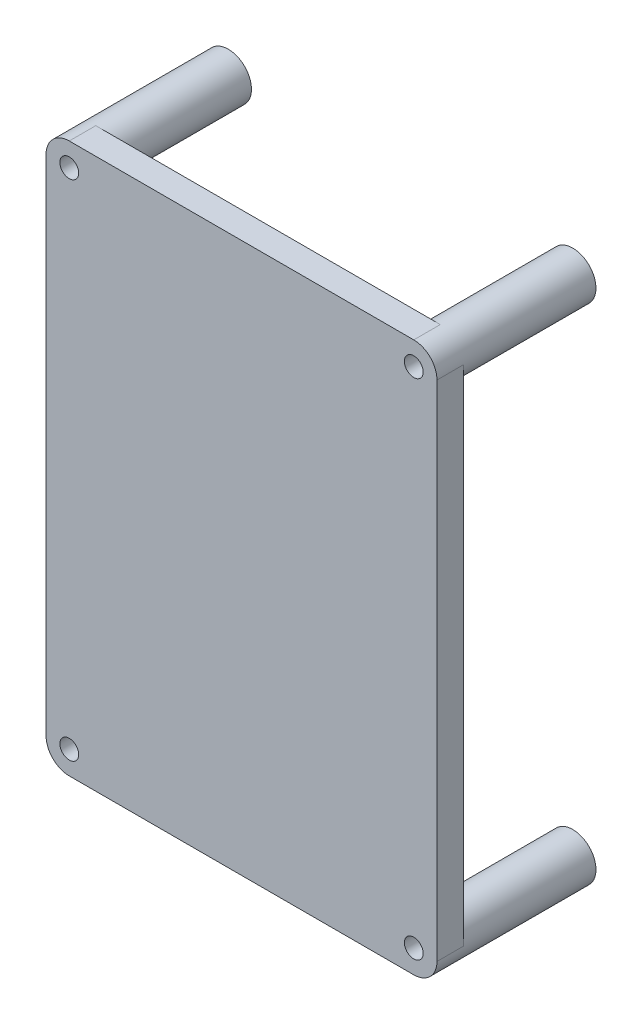
ISO-10303-21;
HEADER;
FILE_DESCRIPTION(('STEP AP214'),'2;1');
FILE_NAME('part.step','',(''),(''),'','','');
FILE_SCHEMA(('AUTOMOTIVE_DESIGN { 1 0 10303 214 1 1 1 1 }'));
ENDSEC;
DATA;
#1=APPLICATION_CONTEXT('core data for automotive mechanical design processes');
#2=APPLICATION_PROTOCOL_DEFINITION('international standard','automotive_design',2000,#1);
#3=PRODUCT_CONTEXT('',#1,'mechanical');
#4=PRODUCT('Part','Part','',(#3));
#5=PRODUCT_RELATED_PRODUCT_CATEGORY('part','',(#4));
#6=PRODUCT_DEFINITION_FORMATION('','',#4);
#7=PRODUCT_DEFINITION_CONTEXT('part definition',#1,'design');
#8=PRODUCT_DEFINITION('design','',#6,#7);
#9=PRODUCT_DEFINITION_SHAPE('','',#8);
#10=(LENGTH_UNIT() NAMED_UNIT(*) SI_UNIT(.MILLI.,.METRE.));
#11=(NAMED_UNIT(*) PLANE_ANGLE_UNIT() SI_UNIT($,.RADIAN.));
#12=(NAMED_UNIT(*) SI_UNIT($,.STERADIAN.) SOLID_ANGLE_UNIT());
#13=UNCERTAINTY_MEASURE_WITH_UNIT(LENGTH_MEASURE(1.E-05),#10,'distance_accuracy_value','');
#14=(GEOMETRIC_REPRESENTATION_CONTEXT(3) GLOBAL_UNCERTAINTY_ASSIGNED_CONTEXT((#13)) GLOBAL_UNIT_ASSIGNED_CONTEXT((#10,
#11,#12)) REPRESENTATION_CONTEXT('',''));
#15=CARTESIAN_POINT('',(0.,0.,0.));
#16=DIRECTION('',(0.,0.,1.));
#17=DIRECTION('',(1.,0.,0.));
#18=AXIS2_PLACEMENT_3D('',#15,#16,#17);
#19=CARTESIAN_POINT('',(160.526557276723,113.230165260636,186.266714262562));
#20=DIRECTION('',(0.,0.,-1.));
#21=DIRECTION('',(-1.,0.,0.));
#22=AXIS2_PLACEMENT_3D('',#19,#20,#21);
#23=PLANE('',#22);
#24=CARTESIAN_POINT('',(160.526557276723,113.230165260636,186.266714262562));
#25=DIRECTION('',(0.,0.,-1.));
#26=DIRECTION('',(-1.,0.,0.));
#27=AXIS2_PLACEMENT_3D('',#24,#25,#26);
#28=CIRCLE('',#27,1.42240000000002);
#29=CARTESIAN_POINT('',(159.104157276723,113.230165260636,186.266714262562));
#30=VERTEX_POINT('',#29);
#31=EDGE_CURVE('E95',#30,#30,#28,.F.);
#32=ORIENTED_EDGE('',*,*,#31,.T.);
#33=EDGE_LOOP('',(#32));
#34=FACE_BOUND('',#33,.T.);
#35=CARTESIAN_POINT('',(160.526557276723,113.230165260636,186.266714262562));
#36=DIRECTION('',(0.,0.,-1.));
#37=DIRECTION('',(-1.,0.,0.));
#38=AXIS2_PLACEMENT_3D('',#35,#36,#37);
#39=CIRCLE('',#38,3.5);
#40=CARTESIAN_POINT('',(157.026557276723,113.230165260636,186.266714262562));
#41=VERTEX_POINT('',#40);
#42=EDGE_CURVE('E94',#41,#41,#39,.F.);
#43=ORIENTED_EDGE('',*,*,#42,.F.);
#44=EDGE_LOOP('',(#43));
#45=FACE_BOUND('',#44,.T.);
#46=ADVANCED_FACE('F17',(#34,#45),#23,.T.);
#47=CARTESIAN_POINT('',(160.526557276723,189.230165260636,186.266714262562));
#48=DIRECTION('',(0.,0.,-1.));
#49=DIRECTION('',(-1.,0.,0.));
#50=AXIS2_PLACEMENT_3D('',#47,#48,#49);
#51=PLANE('',#50);
#52=CARTESIAN_POINT('',(160.526557276723,189.230165260636,186.266714262562));
#53=DIRECTION('',(0.,0.,-1.));
#54=DIRECTION('',(-1.,0.,0.));
#55=AXIS2_PLACEMENT_3D('',#52,#53,#54);
#56=CIRCLE('',#55,1.42240000000002);
#57=CARTESIAN_POINT('',(159.104157276723,189.230165260636,186.266714262562));
#58=VERTEX_POINT('',#57);
#59=EDGE_CURVE('E20',#58,#58,#56,.F.);
#60=ORIENTED_EDGE('',*,*,#59,.T.);
#61=EDGE_LOOP('',(#60));
#62=FACE_BOUND('',#61,.T.);
#63=CARTESIAN_POINT('',(160.526557276723,189.230165260636,186.266714262562));
#64=DIRECTION('',(0.,0.,-1.));
#65=DIRECTION('',(-1.,0.,0.));
#66=AXIS2_PLACEMENT_3D('',#63,#64,#65);
#67=CIRCLE('',#66,3.5);
#68=CARTESIAN_POINT('',(157.026557276723,189.230165260636,186.266714262562));
#69=VERTEX_POINT('',#68);
#70=EDGE_CURVE('E163',#69,#69,#67,.F.);
#71=ORIENTED_EDGE('',*,*,#70,.F.);
#72=EDGE_LOOP('',(#71));
#73=FACE_BOUND('',#72,.T.);
#74=ADVANCED_FACE('F171',(#62,#73),#51,.T.);
#75=CARTESIAN_POINT('',(160.526557276723,113.230165260636,206.266714262562));
#76=DIRECTION('',(0.,0.,1.));
#77=DIRECTION('',(1.,0.,0.));
#78=AXIS2_PLACEMENT_3D('',#75,#76,#77);
#79=PLANE('',#78);
#80=DIRECTION('',(0.,1.,0.));
#81=VECTOR('',#80,1.);
#82=CARTESIAN_POINT('',(105.026557276723,189.230165260636,206.266714262562));
#83=LINE('',#82,#81);
#84=CARTESIAN_POINT('',(105.026557276723,113.230165260636,206.266714262562));
#85=VERTEX_POINT('',#84);
#86=CARTESIAN_POINT('',(105.026557276723,189.230165260636,206.266714262562));
#87=VERTEX_POINT('',#86);
#88=EDGE_CURVE('E117',#85,#87,#83,.T.);
#89=ORIENTED_EDGE('',*,*,#88,.T.);
#90=CARTESIAN_POINT('',(108.526557276723,189.230165260636,206.266714262562));
#91=DIRECTION('',(0.,0.,-1.));
#92=DIRECTION('',(-1.,0.,0.));
#93=AXIS2_PLACEMENT_3D('',#90,#91,#92);
#94=CIRCLE('',#93,3.49999999999999);
#95=CARTESIAN_POINT('',(108.526557276723,192.730165260636,206.266714262562));
#96=VERTEX_POINT('',#95);
#97=EDGE_CURVE('E122',#96,#87,#94,.T.);
#98=ORIENTED_EDGE('',*,*,#97,.F.);
#99=DIRECTION('',(1.,0.,0.));
#100=VECTOR('',#99,1.);
#101=CARTESIAN_POINT('',(160.526557276723,192.730165260636,206.266714262562));
#102=LINE('',#101,#100);
#103=CARTESIAN_POINT('',(160.526557276723,192.730165260636,206.266714262562));
#104=VERTEX_POINT('',#103);
#105=EDGE_CURVE('E121',#96,#104,#102,.T.);
#106=ORIENTED_EDGE('',*,*,#105,.T.);
#107=CARTESIAN_POINT('',(160.526557276723,189.230165260636,206.266714262562));
#108=DIRECTION('',(0.,0.,-1.));
#109=DIRECTION('',(-1.,0.,0.));
#110=AXIS2_PLACEMENT_3D('',#107,#108,#109);
#111=CIRCLE('',#110,3.5);
#112=CARTESIAN_POINT('',(164.026557276723,189.230165260636,206.266714262562));
#113=VERTEX_POINT('',#112);
#114=EDGE_CURVE('E79',#113,#104,#111,.T.);
#115=ORIENTED_EDGE('',*,*,#114,.F.);
#116=DIRECTION('',(0.,-1.,0.));
#117=VECTOR('',#116,1.);
#118=CARTESIAN_POINT('',(164.026557276723,113.230165260636,206.266714262562));
#119=LINE('',#118,#117);
#120=CARTESIAN_POINT('',(164.026557276723,113.230165260636,206.266714262562));
#121=VERTEX_POINT('',#120);
#122=EDGE_CURVE('E97',#113,#121,#119,.T.);
#123=ORIENTED_EDGE('',*,*,#122,.T.);
#124=CARTESIAN_POINT('',(160.526557276723,113.230165260636,206.266714262562));
#125=DIRECTION('',(0.,0.,-1.));
#126=DIRECTION('',(-1.,0.,0.));
#127=AXIS2_PLACEMENT_3D('',#124,#125,#126);
#128=CIRCLE('',#127,3.5);
#129=CARTESIAN_POINT('',(160.526557276723,109.730165260636,206.266714262562));
#130=VERTEX_POINT('',#129);
#131=EDGE_CURVE('E84',#130,#121,#128,.T.);
#132=ORIENTED_EDGE('',*,*,#131,.F.);
#133=DIRECTION('',(-1.,0.,0.));
#134=VECTOR('',#133,1.);
#135=CARTESIAN_POINT('',(108.526557276723,109.730165260636,206.266714262562));
#136=LINE('',#135,#134);
#137=CARTESIAN_POINT('',(108.526557276723,109.730165260636,206.266714262562));
#138=VERTEX_POINT('',#137);
#139=EDGE_CURVE('E114',#130,#138,#136,.T.);
#140=ORIENTED_EDGE('',*,*,#139,.T.);
#141=CARTESIAN_POINT('',(108.526557276723,113.230165260636,206.266714262562));
#142=DIRECTION('',(0.,0.,-1.));
#143=DIRECTION('',(-1.,0.,0.));
#144=AXIS2_PLACEMENT_3D('',#141,#142,#143);
#145=CIRCLE('',#144,3.50000000000002);
#146=EDGE_CURVE('E119',#85,#138,#145,.T.);
#147=ORIENTED_EDGE('',*,*,#146,.F.);
#148=EDGE_LOOP('',(#89,#98,#106,#115,#123,#132,#140,#147));
#149=FACE_BOUND('',#148,.T.);
#150=ADVANCED_FACE('F99',(#149),#79,.F.);
#151=CARTESIAN_POINT('',(108.526557276723,113.230165260636,186.266714262562));
#152=DIRECTION('',(0.,0.,-1.));
#153=DIRECTION('',(-1.,0.,0.));
#154=AXIS2_PLACEMENT_3D('',#151,#152,#153);
#155=PLANE('',#154);
#156=CARTESIAN_POINT('',(108.526557276723,113.230165260636,186.266714262562));
#157=DIRECTION('',(0.,0.,-1.));
#158=DIRECTION('',(-1.,0.,0.));
#159=AXIS2_PLACEMENT_3D('',#156,#157,#158);
#160=CIRCLE('',#159,1.42239999999998);
#161=CARTESIAN_POINT('',(107.104157276723,113.230165260636,186.266714262562));
#162=VERTEX_POINT('',#161);
#163=EDGE_CURVE('E116',#162,#162,#160,.F.);
#164=ORIENTED_EDGE('',*,*,#163,.T.);
#165=EDGE_LOOP('',(#164));
#166=FACE_BOUND('',#165,.T.);
#167=CARTESIAN_POINT('',(108.526557276723,113.230165260636,186.266714262562));
#168=DIRECTION('',(0.,0.,-1.));
#169=DIRECTION('',(-1.,0.,0.));
#170=AXIS2_PLACEMENT_3D('',#167,#168,#169);
#171=CIRCLE('',#170,3.50000000000002);
#172=CARTESIAN_POINT('',(105.026557276723,113.230165260636,186.266714262562));
#173=VERTEX_POINT('',#172);
#174=EDGE_CURVE('E152',#173,#173,#171,.F.);
#175=ORIENTED_EDGE('',*,*,#174,.F.);
#176=EDGE_LOOP('',(#175));
#177=FACE_BOUND('',#176,.T.);
#178=ADVANCED_FACE('F187',(#166,#177),#155,.T.);
#179=CARTESIAN_POINT('',(108.526557276723,189.230165260636,186.266714262562));
#180=DIRECTION('',(0.,0.,-1.));
#181=DIRECTION('',(-1.,0.,0.));
#182=AXIS2_PLACEMENT_3D('',#179,#180,#181);
#183=PLANE('',#182);
#184=CARTESIAN_POINT('',(108.526557276723,189.230165260636,186.266714262562));
#185=DIRECTION('',(0.,0.,-1.));
#186=DIRECTION('',(-1.,0.,0.));
#187=AXIS2_PLACEMENT_3D('',#184,#185,#186);
#188=CIRCLE('',#187,1.4224);
#189=CARTESIAN_POINT('',(107.104157276723,189.230165260636,186.266714262562));
#190=VERTEX_POINT('',#189);
#191=EDGE_CURVE('E147',#190,#190,#188,.F.);
#192=ORIENTED_EDGE('',*,*,#191,.T.);
#193=EDGE_LOOP('',(#192));
#194=FACE_BOUND('',#193,.T.);
#195=CARTESIAN_POINT('',(108.526557276723,189.230165260636,186.266714262562));
#196=DIRECTION('',(0.,0.,-1.));
#197=DIRECTION('',(-1.,0.,0.));
#198=AXIS2_PLACEMENT_3D('',#195,#196,#197);
#199=CIRCLE('',#198,3.49999999999999);
#200=CARTESIAN_POINT('',(105.026557276723,189.230165260636,186.266714262562));
#201=VERTEX_POINT('',#200);
#202=EDGE_CURVE('E157',#201,#201,#199,.F.);
#203=ORIENTED_EDGE('',*,*,#202,.F.);
#204=EDGE_LOOP('',(#203));
#205=FACE_BOUND('',#204,.T.);
#206=ADVANCED_FACE('F177',(#194,#205),#183,.T.);
#207=CARTESIAN_POINT('',(160.526557276723,189.230165260636,210.266714262562));
#208=DIRECTION('',(0.,0.,-1.));
#209=DIRECTION('',(-1.,0.,0.));
#210=AXIS2_PLACEMENT_3D('',#207,#208,#209);
#211=CYLINDRICAL_SURFACE('',#210,1.42240000000002);
#212=CARTESIAN_POINT('',(160.526557276723,189.230165260636,210.266714262562));
#213=DIRECTION('',(0.,0.,-1.));
#214=DIRECTION('',(-1.,0.,0.));
#215=AXIS2_PLACEMENT_3D('',#212,#213,#214);
#216=CIRCLE('',#215,1.42240000000002);
#217=CARTESIAN_POINT('',(159.104157276723,189.230165260636,210.266714262562));
#218=VERTEX_POINT('',#217);
#219=EDGE_CURVE('E144',#218,#218,#216,.T.);
#220=ORIENTED_EDGE('',*,*,#219,.F.);
#221=EDGE_LOOP('',(#220));
#222=FACE_BOUND('',#221,.T.);
#223=ORIENTED_EDGE('',*,*,#59,.F.);
#224=EDGE_LOOP('',(#223));
#225=FACE_BOUND('',#224,.T.);
#226=ADVANCED_FACE('F174',(#222,#225),#211,.F.);
#227=CARTESIAN_POINT('',(160.526557276723,113.230165260636,210.266714262562));
#228=DIRECTION('',(0.,0.,-1.));
#229=DIRECTION('',(-1.,0.,0.));
#230=AXIS2_PLACEMENT_3D('',#227,#228,#229);
#231=CYLINDRICAL_SURFACE('',#230,1.42240000000002);
#232=CARTESIAN_POINT('',(160.526557276723,113.230165260636,210.266714262562));
#233=DIRECTION('',(0.,0.,-1.));
#234=DIRECTION('',(-1.,0.,0.));
#235=AXIS2_PLACEMENT_3D('',#232,#233,#234);
#236=CIRCLE('',#235,1.42240000000002);
#237=CARTESIAN_POINT('',(159.104157276723,113.230165260636,210.266714262562));
#238=VERTEX_POINT('',#237);
#239=EDGE_CURVE('E141',#238,#238,#236,.T.);
#240=ORIENTED_EDGE('',*,*,#239,.F.);
#241=EDGE_LOOP('',(#240));
#242=FACE_BOUND('',#241,.T.);
#243=ORIENTED_EDGE('',*,*,#31,.F.);
#244=EDGE_LOOP('',(#243));
#245=FACE_BOUND('',#244,.T.);
#246=ADVANCED_FACE('F176',(#242,#245),#231,.F.);
#247=CARTESIAN_POINT('',(160.526557276723,113.230165260636,210.266714262562));
#248=DIRECTION('',(0.,0.,-1.));
#249=DIRECTION('',(-1.,0.,0.));
#250=AXIS2_PLACEMENT_3D('',#247,#248,#249);
#251=CYLINDRICAL_SURFACE('',#250,3.5);
#252=ORIENTED_EDGE('',*,*,#131,.T.);
#253=DIRECTION('',(0.,0.,1.));
#254=VECTOR('',#253,1.);
#255=CARTESIAN_POINT('',(164.026557276723,113.230165260636,210.266714262562));
#256=LINE('',#255,#254);
#257=CARTESIAN_POINT('',(164.026557276723,113.230165260636,210.266714262562));
#258=VERTEX_POINT('',#257);
#259=EDGE_CURVE('E88',#121,#258,#256,.T.);
#260=ORIENTED_EDGE('',*,*,#259,.T.);
#261=CARTESIAN_POINT('',(160.526557276723,113.230165260636,210.266714262562));
#262=DIRECTION('',(0.,0.,-1.));
#263=DIRECTION('',(-1.,0.,0.));
#264=AXIS2_PLACEMENT_3D('',#261,#262,#263);
#265=CIRCLE('',#264,3.5);
#266=CARTESIAN_POINT('',(160.526557276723,109.730165260636,210.266714262562));
#267=VERTEX_POINT('',#266);
#268=EDGE_CURVE('E139',#267,#258,#265,.F.);
#269=ORIENTED_EDGE('',*,*,#268,.F.);
#270=DIRECTION('',(0.,0.,1.));
#271=VECTOR('',#270,1.);
#272=CARTESIAN_POINT('',(160.526557276723,109.730165260636,210.266714262562));
#273=LINE('',#272,#271);
#274=EDGE_CURVE('E91',#267,#130,#273,.F.);
#275=ORIENTED_EDGE('',*,*,#274,.T.);
#276=EDGE_LOOP('',(#252,#260,#269,#275));
#277=FACE_BOUND('',#276,.T.);
#278=ORIENTED_EDGE('',*,*,#42,.T.);
#279=EDGE_LOOP('',(#278));
#280=FACE_BOUND('',#279,.T.);
#281=ADVANCED_FACE('F85',(#277,#280),#251,.T.);
#282=CARTESIAN_POINT('',(164.026557276723,113.230165260636,210.266714262562));
#283=DIRECTION('',(-1.,0.,0.));
#284=DIRECTION('',(0.,-1.,0.));
#285=AXIS2_PLACEMENT_3D('',#282,#283,#284);
#286=PLANE('',#285);
#287=DIRECTION('',(0.,0.,-1.));
#288=VECTOR('',#287,1.);
#289=CARTESIAN_POINT('',(164.026557276723,189.230165260636,210.266714262562));
#290=LINE('',#289,#288);
#291=CARTESIAN_POINT('',(164.026557276723,189.230165260636,210.266714262562));
#292=VERTEX_POINT('',#291);
#293=EDGE_CURVE('E102',#292,#113,#290,.T.);
#294=ORIENTED_EDGE('',*,*,#293,.F.);
#295=DIRECTION('',(0.,1.,0.));
#296=VECTOR('',#295,1.);
#297=CARTESIAN_POINT('',(164.026557276723,113.230165260636,210.266714262562));
#298=LINE('',#297,#296);
#299=EDGE_CURVE('E106',#258,#292,#298,.T.);
#300=ORIENTED_EDGE('',*,*,#299,.F.);
#301=ORIENTED_EDGE('',*,*,#259,.F.);
#302=ORIENTED_EDGE('',*,*,#122,.F.);
#303=EDGE_LOOP('',(#294,#300,#301,#302));
#304=FACE_BOUND('',#303,.T.);
#305=ADVANCED_FACE('F104',(#304),#286,.F.);
#306=CARTESIAN_POINT('',(160.526557276723,189.230165260636,210.266714262562));
#307=DIRECTION('',(0.,0.,-1.));
#308=DIRECTION('',(-1.,0.,0.));
#309=AXIS2_PLACEMENT_3D('',#306,#307,#308);
#310=CYLINDRICAL_SURFACE('',#309,3.5);
#311=ORIENTED_EDGE('',*,*,#70,.T.);
#312=EDGE_LOOP('',(#311));
#313=FACE_BOUND('',#312,.T.);
#314=DIRECTION('',(0.,0.,-1.));
#315=VECTOR('',#314,1.);
#316=CARTESIAN_POINT('',(160.526557276723,192.730165260636,210.266714262562));
#317=LINE('',#316,#315);
#318=CARTESIAN_POINT('',(160.526557276723,192.730165260636,210.266714262562));
#319=VERTEX_POINT('',#318);
#320=EDGE_CURVE('E123',#104,#319,#317,.F.);
#321=ORIENTED_EDGE('',*,*,#320,.T.);
#322=CARTESIAN_POINT('',(160.526557276723,189.230165260636,210.266714262562));
#323=DIRECTION('',(0.,0.,-1.));
#324=DIRECTION('',(-1.,0.,0.));
#325=AXIS2_PLACEMENT_3D('',#322,#323,#324);
#326=CIRCLE('',#325,3.5);
#327=EDGE_CURVE('E136',#292,#319,#326,.F.);
#328=ORIENTED_EDGE('',*,*,#327,.F.);
#329=ORIENTED_EDGE('',*,*,#293,.T.);
#330=ORIENTED_EDGE('',*,*,#114,.T.);
#331=EDGE_LOOP('',(#321,#328,#329,#330));
#332=FACE_BOUND('',#331,.T.);
#333=ADVANCED_FACE('F225',(#313,#332),#310,.T.);
#334=CARTESIAN_POINT('',(160.526557276723,192.730165260636,210.266714262562));
#335=DIRECTION('',(0.,-1.,0.));
#336=DIRECTION('',(0.,0.,-1.));
#337=AXIS2_PLACEMENT_3D('',#334,#335,#336);
#338=PLANE('',#337);
#339=DIRECTION('',(0.,0.,-1.));
#340=VECTOR('',#339,1.);
#341=CARTESIAN_POINT('',(108.526557276723,192.730165260636,210.266714262562));
#342=LINE('',#341,#340);
#343=CARTESIAN_POINT('',(108.526557276723,192.730165260636,210.266714262562));
#344=VERTEX_POINT('',#343);
#345=EDGE_CURVE('E160',#344,#96,#342,.T.);
#346=ORIENTED_EDGE('',*,*,#345,.F.);
#347=DIRECTION('',(1.,0.,0.));
#348=VECTOR('',#347,1.);
#349=CARTESIAN_POINT('',(160.526557276723,192.730165260636,210.266714262562));
#350=LINE('',#349,#348);
#351=EDGE_CURVE('E135',#319,#344,#350,.F.);
#352=ORIENTED_EDGE('',*,*,#351,.F.);
#353=ORIENTED_EDGE('',*,*,#320,.F.);
#354=ORIENTED_EDGE('',*,*,#105,.F.);
#355=EDGE_LOOP('',(#346,#352,#353,#354));
#356=FACE_BOUND('',#355,.T.);
#357=ADVANCED_FACE('F221',(#356),#338,.F.);
#358=CARTESIAN_POINT('',(108.526557276723,189.230165260636,210.266714262562));
#359=DIRECTION('',(0.,0.,-1.));
#360=DIRECTION('',(-1.,0.,0.));
#361=AXIS2_PLACEMENT_3D('',#358,#359,#360);
#362=CYLINDRICAL_SURFACE('',#361,3.49999999999999);
#363=ORIENTED_EDGE('',*,*,#202,.T.);
#364=EDGE_LOOP('',(#363));
#365=FACE_BOUND('',#364,.T.);
#366=CARTESIAN_POINT('',(108.526557276723,189.230165260636,210.266714262562));
#367=DIRECTION('',(0.,0.,-1.));
#368=DIRECTION('',(-1.,0.,0.));
#369=AXIS2_PLACEMENT_3D('',#366,#367,#368);
#370=CIRCLE('',#369,3.49999999999999);
#371=CARTESIAN_POINT('',(105.026557276723,189.230165260636,210.266714262562));
#372=VERTEX_POINT('',#371);
#373=EDGE_CURVE('E132',#344,#372,#370,.F.);
#374=ORIENTED_EDGE('',*,*,#373,.F.);
#375=ORIENTED_EDGE('',*,*,#345,.T.);
#376=ORIENTED_EDGE('',*,*,#97,.T.);
#377=DIRECTION('',(0.,0.,1.));
#378=VECTOR('',#377,1.);
#379=CARTESIAN_POINT('',(105.026557276723,189.230165260636,210.266714262562));
#380=LINE('',#379,#378);
#381=EDGE_CURVE('E120',#87,#372,#380,.T.);
#382=ORIENTED_EDGE('',*,*,#381,.T.);
#383=EDGE_LOOP('',(#374,#375,#376,#382));
#384=FACE_BOUND('',#383,.T.);
#385=ADVANCED_FACE('F217',(#365,#384),#362,.T.);
#386=CARTESIAN_POINT('',(105.026557276723,189.230165260636,210.266714262562));
#387=DIRECTION('',(1.,0.,0.));
#388=DIRECTION('',(0.,1.,0.));
#389=AXIS2_PLACEMENT_3D('',#386,#387,#388);
#390=PLANE('',#389);
#391=DIRECTION('',(0.,0.,-1.));
#392=VECTOR('',#391,1.);
#393=CARTESIAN_POINT('',(105.026557276723,113.230165260636,210.266714262562));
#394=LINE('',#393,#392);
#395=CARTESIAN_POINT('',(105.026557276723,113.230165260636,210.266714262562));
#396=VERTEX_POINT('',#395);
#397=EDGE_CURVE('E155',#396,#85,#394,.T.);
#398=ORIENTED_EDGE('',*,*,#397,.F.);
#399=DIRECTION('',(0.,1.,0.));
#400=VECTOR('',#399,1.);
#401=CARTESIAN_POINT('',(105.026557276723,113.230165260636,210.266714262562));
#402=LINE('',#401,#400);
#403=EDGE_CURVE('E131',#372,#396,#402,.F.);
#404=ORIENTED_EDGE('',*,*,#403,.F.);
#405=ORIENTED_EDGE('',*,*,#381,.F.);
#406=ORIENTED_EDGE('',*,*,#88,.F.);
#407=EDGE_LOOP('',(#398,#404,#405,#406));
#408=FACE_BOUND('',#407,.T.);
#409=ADVANCED_FACE('F214',(#408),#390,.F.);
#410=CARTESIAN_POINT('',(108.526557276723,113.230165260636,210.266714262562));
#411=DIRECTION('',(0.,0.,-1.));
#412=DIRECTION('',(-1.,0.,0.));
#413=AXIS2_PLACEMENT_3D('',#410,#411,#412);
#414=CYLINDRICAL_SURFACE('',#413,3.50000000000002);
#415=ORIENTED_EDGE('',*,*,#397,.T.);
#416=ORIENTED_EDGE('',*,*,#146,.T.);
#417=DIRECTION('',(0.,0.,1.));
#418=VECTOR('',#417,1.);
#419=CARTESIAN_POINT('',(108.526557276723,109.730165260636,210.266714262562));
#420=LINE('',#419,#418);
#421=CARTESIAN_POINT('',(108.526557276723,109.730165260636,210.266714262562));
#422=VERTEX_POINT('',#421);
#423=EDGE_CURVE('E35',#138,#422,#420,.T.);
#424=ORIENTED_EDGE('',*,*,#423,.T.);
#425=CARTESIAN_POINT('',(108.526557276723,113.230165260636,210.266714262562));
#426=DIRECTION('',(0.,0.,-1.));
#427=DIRECTION('',(-1.,0.,0.));
#428=AXIS2_PLACEMENT_3D('',#425,#426,#427);
#429=CIRCLE('',#428,3.50000000000002);
#430=EDGE_CURVE('E128',#396,#422,#429,.F.);
#431=ORIENTED_EDGE('',*,*,#430,.F.);
#432=EDGE_LOOP('',(#415,#416,#424,#431));
#433=FACE_BOUND('',#432,.T.);
#434=ORIENTED_EDGE('',*,*,#174,.T.);
#435=EDGE_LOOP('',(#434));
#436=FACE_BOUND('',#435,.T.);
#437=ADVANCED_FACE('F210',(#433,#436),#414,.T.);
#438=CARTESIAN_POINT('',(108.526557276723,109.730165260636,210.266714262562));
#439=DIRECTION('',(0.,1.,0.));
#440=DIRECTION('',(-1.,0.,0.));
#441=AXIS2_PLACEMENT_3D('',#438,#439,#440);
#442=PLANE('',#441);
#443=ORIENTED_EDGE('',*,*,#274,.F.);
#444=DIRECTION('',(1.,0.,0.));
#445=VECTOR('',#444,1.);
#446=CARTESIAN_POINT('',(160.526557276723,109.730165260636,210.266714262562));
#447=LINE('',#446,#445);
#448=EDGE_CURVE('E127',#422,#267,#447,.T.);
#449=ORIENTED_EDGE('',*,*,#448,.F.);
#450=ORIENTED_EDGE('',*,*,#423,.F.);
#451=ORIENTED_EDGE('',*,*,#139,.F.);
#452=EDGE_LOOP('',(#443,#449,#450,#451));
#453=FACE_BOUND('',#452,.T.);
#454=ADVANCED_FACE('F206',(#453),#442,.F.);
#455=CARTESIAN_POINT('',(108.526557276723,113.230165260636,210.266714262562));
#456=DIRECTION('',(0.,0.,-1.));
#457=DIRECTION('',(-1.,0.,0.));
#458=AXIS2_PLACEMENT_3D('',#455,#456,#457);
#459=CYLINDRICAL_SURFACE('',#458,1.42239999999998);
#460=CARTESIAN_POINT('',(108.526557276723,113.230165260636,210.266714262562));
#461=DIRECTION('',(0.,0.,-1.));
#462=DIRECTION('',(-1.,0.,0.));
#463=AXIS2_PLACEMENT_3D('',#460,#461,#462);
#464=CIRCLE('',#463,1.42239999999998);
#465=CARTESIAN_POINT('',(107.104157276723,113.230165260636,210.266714262562));
#466=VERTEX_POINT('',#465);
#467=EDGE_CURVE('E26',#466,#466,#464,.T.);
#468=ORIENTED_EDGE('',*,*,#467,.F.);
#469=EDGE_LOOP('',(#468));
#470=FACE_BOUND('',#469,.T.);
#471=ORIENTED_EDGE('',*,*,#163,.F.);
#472=EDGE_LOOP('',(#471));
#473=FACE_BOUND('',#472,.T.);
#474=ADVANCED_FACE('F199',(#470,#473),#459,.F.);
#475=CARTESIAN_POINT('',(108.526557276723,189.230165260636,210.266714262562));
#476=DIRECTION('',(0.,0.,-1.));
#477=DIRECTION('',(-1.,0.,0.));
#478=AXIS2_PLACEMENT_3D('',#475,#476,#477);
#479=CYLINDRICAL_SURFACE('',#478,1.4224);
#480=CARTESIAN_POINT('',(108.526557276723,189.230165260636,210.266714262562));
#481=DIRECTION('',(0.,0.,-1.));
#482=DIRECTION('',(-1.,0.,0.));
#483=AXIS2_PLACEMENT_3D('',#480,#481,#482);
#484=CIRCLE('',#483,1.4224);
#485=CARTESIAN_POINT('',(107.104157276723,189.230165260636,210.266714262562));
#486=VERTEX_POINT('',#485);
#487=EDGE_CURVE('E10',#486,#486,#484,.T.);
#488=ORIENTED_EDGE('',*,*,#487,.F.);
#489=EDGE_LOOP('',(#488));
#490=FACE_BOUND('',#489,.T.);
#491=ORIENTED_EDGE('',*,*,#191,.F.);
#492=EDGE_LOOP('',(#491));
#493=FACE_BOUND('',#492,.T.);
#494=ADVANCED_FACE('F193',(#490,#493),#479,.F.);
#495=CARTESIAN_POINT('',(160.526557276723,113.230165260636,210.266714262562));
#496=DIRECTION('',(0.,0.,1.));
#497=DIRECTION('',(1.,0.,0.));
#498=AXIS2_PLACEMENT_3D('',#495,#496,#497);
#499=PLANE('',#498);
#500=ORIENTED_EDGE('',*,*,#487,.T.);
#501=EDGE_LOOP('',(#500));
#502=FACE_BOUND('',#501,.T.);
#503=ORIENTED_EDGE('',*,*,#467,.T.);
#504=EDGE_LOOP('',(#503));
#505=FACE_BOUND('',#504,.T.);
#506=ORIENTED_EDGE('',*,*,#430,.T.);
#507=ORIENTED_EDGE('',*,*,#448,.T.);
#508=ORIENTED_EDGE('',*,*,#268,.T.);
#509=ORIENTED_EDGE('',*,*,#299,.T.);
#510=ORIENTED_EDGE('',*,*,#327,.T.);
#511=ORIENTED_EDGE('',*,*,#351,.T.);
#512=ORIENTED_EDGE('',*,*,#373,.T.);
#513=ORIENTED_EDGE('',*,*,#403,.T.);
#514=EDGE_LOOP('',(#506,#507,#508,#509,#510,#511,#512,#513));
#515=FACE_BOUND('',#514,.T.);
#516=ORIENTED_EDGE('',*,*,#239,.T.);
#517=EDGE_LOOP('',(#516));
#518=FACE_BOUND('',#517,.T.);
#519=ORIENTED_EDGE('',*,*,#219,.T.);
#520=EDGE_LOOP('',(#519));
#521=FACE_BOUND('',#520,.T.);
#522=ADVANCED_FACE('F191',(#502,#505,#515,#518,#521),#499,.T.);
#523=CLOSED_SHELL('',(#46,#74,#150,#178,#206,#226,#246,#281,#305,#333,#357,#385,#409,#437,#454,
#474,#494,#522));
#524=MANIFOLD_SOLID_BREP('B1',#523);
#525=ADVANCED_BREP_SHAPE_REPRESENTATION('',(#18,#524),#14);
#526=SHAPE_DEFINITION_REPRESENTATION(#9,#525);
ENDSEC;
END-ISO-10303-21;
